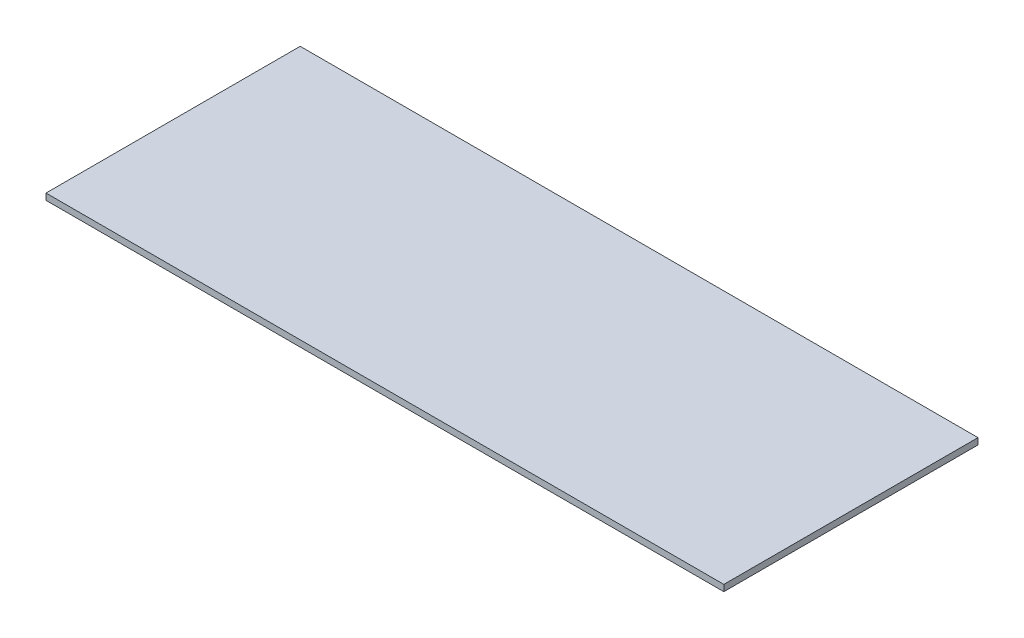
ISO-10303-21;
HEADER;
FILE_DESCRIPTION(('STEP AP214'),'2;1');
FILE_NAME('part.step','',(''),(''),'','','');
FILE_SCHEMA(('AUTOMOTIVE_DESIGN { 1 0 10303 214 1 1 1 1 }'));
ENDSEC;
DATA;
#1=APPLICATION_CONTEXT('core data for automotive mechanical design processes');
#2=APPLICATION_PROTOCOL_DEFINITION('international standard','automotive_design',2000,#1);
#3=PRODUCT_CONTEXT('',#1,'mechanical');
#4=PRODUCT('Part','Part','',(#3));
#5=PRODUCT_RELATED_PRODUCT_CATEGORY('part','',(#4));
#6=PRODUCT_DEFINITION_FORMATION('','',#4);
#7=PRODUCT_DEFINITION_CONTEXT('part definition',#1,'design');
#8=PRODUCT_DEFINITION('design','',#6,#7);
#9=PRODUCT_DEFINITION_SHAPE('','',#8);
#10=(LENGTH_UNIT() NAMED_UNIT(*) SI_UNIT(.MILLI.,.METRE.));
#11=(NAMED_UNIT(*) PLANE_ANGLE_UNIT() SI_UNIT($,.RADIAN.));
#12=(NAMED_UNIT(*) SI_UNIT($,.STERADIAN.) SOLID_ANGLE_UNIT());
#13=UNCERTAINTY_MEASURE_WITH_UNIT(LENGTH_MEASURE(1.E-05),#10,'distance_accuracy_value','');
#14=(GEOMETRIC_REPRESENTATION_CONTEXT(3) GLOBAL_UNCERTAINTY_ASSIGNED_CONTEXT((#13)) GLOBAL_UNIT_ASSIGNED_CONTEXT((#10,
#11,#12)) REPRESENTATION_CONTEXT('',''));
#15=CARTESIAN_POINT('',(0.,0.,0.));
#16=DIRECTION('',(0.,0.,1.));
#17=DIRECTION('',(1.,0.,0.));
#18=AXIS2_PLACEMENT_3D('',#15,#16,#17);
#19=CARTESIAN_POINT('',(80.,1.5,-30.));
#20=DIRECTION('',(-1.,0.,0.));
#21=DIRECTION('',(0.,0.,1.));
#22=AXIS2_PLACEMENT_3D('',#19,#20,#21);
#23=PLANE('',#22);
#24=DIRECTION('',(0.,0.,-1.));
#25=VECTOR('',#24,1.);
#26=CARTESIAN_POINT('',(80.,0.,-30.));
#27=LINE('',#26,#25);
#28=CARTESIAN_POINT('',(80.,0.,30.));
#29=VERTEX_POINT('',#28);
#30=CARTESIAN_POINT('',(80.,0.,-30.));
#31=VERTEX_POINT('',#30);
#32=EDGE_CURVE('E98',#29,#31,#27,.T.);
#33=ORIENTED_EDGE('',*,*,#32,.T.);
#34=DIRECTION('',(0.,-1.,0.));
#35=VECTOR('',#34,1.);
#36=CARTESIAN_POINT('',(80.,1.5,-30.));
#37=LINE('',#36,#35);
#38=CARTESIAN_POINT('',(80.,1.5,-30.));
#39=VERTEX_POINT('',#38);
#40=EDGE_CURVE('E11',#39,#31,#37,.T.);
#41=ORIENTED_EDGE('',*,*,#40,.F.);
#42=DIRECTION('',(0.,0.,-1.));
#43=VECTOR('',#42,1.);
#44=CARTESIAN_POINT('',(80.,1.5,-30.));
#45=LINE('',#44,#43);
#46=CARTESIAN_POINT('',(80.,1.5,30.));
#47=VERTEX_POINT('',#46);
#48=EDGE_CURVE('E86',#47,#39,#45,.T.);
#49=ORIENTED_EDGE('',*,*,#48,.F.);
#50=DIRECTION('',(0.,-1.,0.));
#51=VECTOR('',#50,1.);
#52=CARTESIAN_POINT('',(80.,1.5,30.));
#53=LINE('',#52,#51);
#54=EDGE_CURVE('E94',#47,#29,#53,.T.);
#55=ORIENTED_EDGE('',*,*,#54,.T.);
#56=EDGE_LOOP('',(#33,#41,#49,#55));
#57=FACE_BOUND('',#56,.T.);
#58=ADVANCED_FACE('F35',(#57),#23,.F.);
#59=CARTESIAN_POINT('',(-80.,1.5,-30.));
#60=DIRECTION('',(0.,0.,1.));
#61=DIRECTION('',(1.,0.,0.));
#62=AXIS2_PLACEMENT_3D('',#59,#60,#61);
#63=PLANE('',#62);
#64=DIRECTION('',(-1.,0.,0.));
#65=VECTOR('',#64,1.);
#66=CARTESIAN_POINT('',(-80.,0.,-30.));
#67=LINE('',#66,#65);
#68=CARTESIAN_POINT('',(-80.,0.,-30.));
#69=VERTEX_POINT('',#68);
#70=EDGE_CURVE('E90',#31,#69,#67,.T.);
#71=ORIENTED_EDGE('',*,*,#70,.T.);
#72=DIRECTION('',(0.,-1.,0.));
#73=VECTOR('',#72,1.);
#74=CARTESIAN_POINT('',(-80.,1.5,-30.));
#75=LINE('',#74,#73);
#76=CARTESIAN_POINT('',(-80.,1.5,-30.));
#77=VERTEX_POINT('',#76);
#78=EDGE_CURVE('E43',#77,#69,#75,.T.);
#79=ORIENTED_EDGE('',*,*,#78,.F.);
#80=DIRECTION('',(-1.,0.,0.));
#81=VECTOR('',#80,1.);
#82=CARTESIAN_POINT('',(-80.,1.5,-30.));
#83=LINE('',#82,#81);
#84=EDGE_CURVE('E81',#39,#77,#83,.T.);
#85=ORIENTED_EDGE('',*,*,#84,.F.);
#86=ORIENTED_EDGE('',*,*,#40,.T.);
#87=EDGE_LOOP('',(#71,#79,#85,#86));
#88=FACE_BOUND('',#87,.T.);
#89=ADVANCED_FACE('F89',(#88),#63,.F.);
#90=CARTESIAN_POINT('',(-80.,1.5,-30.));
#91=DIRECTION('',(1.,0.,0.));
#92=DIRECTION('',(0.,0.,-1.));
#93=AXIS2_PLACEMENT_3D('',#90,#91,#92);
#94=PLANE('',#93);
#95=DIRECTION('',(0.,0.,1.));
#96=VECTOR('',#95,1.);
#97=CARTESIAN_POINT('',(-80.,0.,-30.));
#98=LINE('',#97,#96);
#99=CARTESIAN_POINT('',(-80.,0.,30.));
#100=VERTEX_POINT('',#99);
#101=EDGE_CURVE('E68',#69,#100,#98,.T.);
#102=ORIENTED_EDGE('',*,*,#101,.T.);
#103=DIRECTION('',(0.,-1.,0.));
#104=VECTOR('',#103,1.);
#105=CARTESIAN_POINT('',(-80.,1.5,30.));
#106=LINE('',#105,#104);
#107=CARTESIAN_POINT('',(-80.,1.5,30.));
#108=VERTEX_POINT('',#107);
#109=EDGE_CURVE('E91',#108,#100,#106,.T.);
#110=ORIENTED_EDGE('',*,*,#109,.F.);
#111=DIRECTION('',(0.,0.,1.));
#112=VECTOR('',#111,1.);
#113=CARTESIAN_POINT('',(-80.,1.5,-30.));
#114=LINE('',#113,#112);
#115=EDGE_CURVE('E84',#77,#108,#114,.T.);
#116=ORIENTED_EDGE('',*,*,#115,.F.);
#117=ORIENTED_EDGE('',*,*,#78,.T.);
#118=EDGE_LOOP('',(#102,#110,#116,#117));
#119=FACE_BOUND('',#118,.T.);
#120=ADVANCED_FACE('F92',(#119),#94,.F.);
#121=CARTESIAN_POINT('',(-80.,1.5,30.));
#122=DIRECTION('',(0.,0.,-1.));
#123=DIRECTION('',(-1.,0.,0.));
#124=AXIS2_PLACEMENT_3D('',#121,#122,#123);
#125=PLANE('',#124);
#126=DIRECTION('',(1.,0.,0.));
#127=VECTOR('',#126,1.);
#128=CARTESIAN_POINT('',(-80.,0.,30.));
#129=LINE('',#128,#127);
#130=EDGE_CURVE('E74',#100,#29,#129,.T.);
#131=ORIENTED_EDGE('',*,*,#130,.T.);
#132=ORIENTED_EDGE('',*,*,#54,.F.);
#133=DIRECTION('',(1.,0.,0.));
#134=VECTOR('',#133,1.);
#135=CARTESIAN_POINT('',(-80.,1.5,30.));
#136=LINE('',#135,#134);
#137=EDGE_CURVE('E51',#108,#47,#136,.T.);
#138=ORIENTED_EDGE('',*,*,#137,.F.);
#139=ORIENTED_EDGE('',*,*,#109,.T.);
#140=EDGE_LOOP('',(#131,#132,#138,#139));
#141=FACE_BOUND('',#140,.T.);
#142=ADVANCED_FACE('F105',(#141),#125,.F.);
#143=CARTESIAN_POINT('',(0.,1.5,0.));
#144=DIRECTION('',(0.,1.,0.));
#145=DIRECTION('',(0.,0.,1.));
#146=AXIS2_PLACEMENT_3D('',#143,#144,#145);
#147=PLANE('',#146);
#148=ORIENTED_EDGE('',*,*,#48,.T.);
#149=ORIENTED_EDGE('',*,*,#84,.T.);
#150=ORIENTED_EDGE('',*,*,#115,.T.);
#151=ORIENTED_EDGE('',*,*,#137,.T.);
#152=EDGE_LOOP('',(#148,#149,#150,#151));
#153=FACE_BOUND('',#152,.T.);
#154=ADVANCED_FACE('F82',(#153),#147,.T.);
#155=CARTESIAN_POINT('',(0.,0.,0.));
#156=DIRECTION('',(0.,1.,0.));
#157=DIRECTION('',(0.,0.,1.));
#158=AXIS2_PLACEMENT_3D('',#155,#156,#157);
#159=PLANE('',#158);
#160=ORIENTED_EDGE('',*,*,#32,.F.);
#161=ORIENTED_EDGE('',*,*,#130,.F.);
#162=ORIENTED_EDGE('',*,*,#101,.F.);
#163=ORIENTED_EDGE('',*,*,#70,.F.);
#164=EDGE_LOOP('',(#160,#161,#162,#163));
#165=FACE_BOUND('',#164,.T.);
#166=ADVANCED_FACE('F108',(#165),#159,.F.);
#167=CLOSED_SHELL('',(#58,#89,#120,#142,#154,#166));
#168=MANIFOLD_SOLID_BREP('B2',#167);
#169=ADVANCED_BREP_SHAPE_REPRESENTATION('',(#18,#168),#14);
#170=SHAPE_DEFINITION_REPRESENTATION(#9,#169);
ENDSEC;
END-ISO-10303-21;
